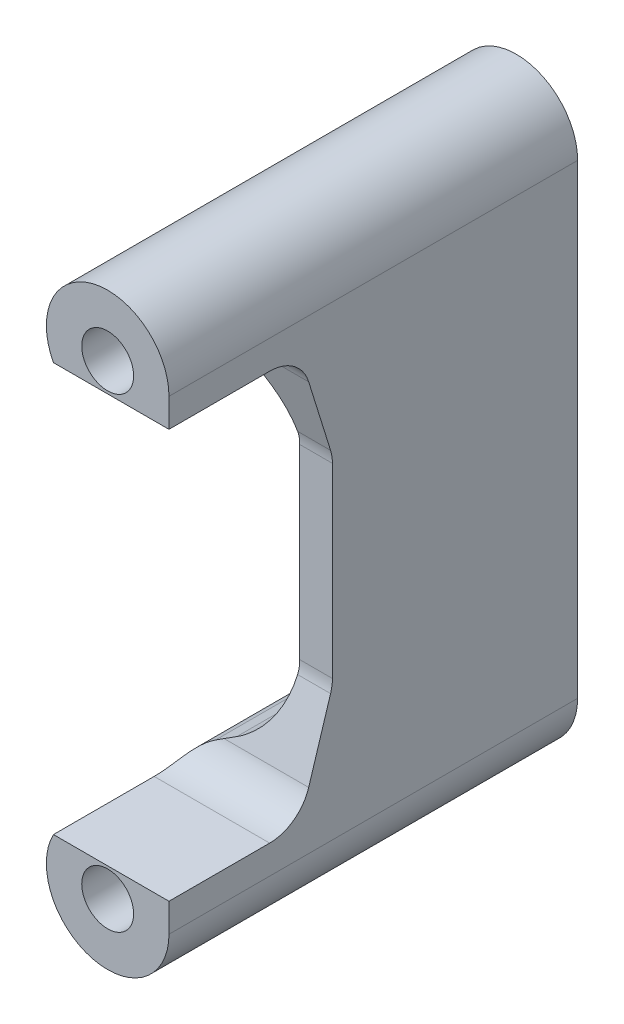
ISO-10303-21;
HEADER;
FILE_DESCRIPTION(('STEP AP214'),'2;1');
FILE_NAME('part.step','',(''),(''),'','','');
FILE_SCHEMA(('AUTOMOTIVE_DESIGN { 1 0 10303 214 1 1 1 1 }'));
ENDSEC;
DATA;
#1=APPLICATION_CONTEXT('core data for automotive mechanical design processes');
#2=APPLICATION_PROTOCOL_DEFINITION('international standard','automotive_design',2000,#1);
#3=PRODUCT_CONTEXT('',#1,'mechanical');
#4=PRODUCT('Part','Part','',(#3));
#5=PRODUCT_RELATED_PRODUCT_CATEGORY('part','',(#4));
#6=PRODUCT_DEFINITION_FORMATION('','',#4);
#7=PRODUCT_DEFINITION_CONTEXT('part definition',#1,'design');
#8=PRODUCT_DEFINITION('design','',#6,#7);
#9=PRODUCT_DEFINITION_SHAPE('','',#8);
#10=(LENGTH_UNIT() NAMED_UNIT(*) SI_UNIT(.MILLI.,.METRE.));
#11=(NAMED_UNIT(*) PLANE_ANGLE_UNIT() SI_UNIT($,.RADIAN.));
#12=(NAMED_UNIT(*) SI_UNIT($,.STERADIAN.) SOLID_ANGLE_UNIT());
#13=UNCERTAINTY_MEASURE_WITH_UNIT(LENGTH_MEASURE(1.E-05),#10,'distance_accuracy_value','');
#14=(GEOMETRIC_REPRESENTATION_CONTEXT(3) GLOBAL_UNCERTAINTY_ASSIGNED_CONTEXT((#13)) GLOBAL_UNIT_ASSIGNED_CONTEXT((#10,
#11,#12)) REPRESENTATION_CONTEXT('',''));
#15=CARTESIAN_POINT('',(0.,0.,0.));
#16=DIRECTION('',(0.,0.,1.));
#17=DIRECTION('',(1.,0.,0.));
#18=AXIS2_PLACEMENT_3D('',#15,#16,#17);
#19=CARTESIAN_POINT('',(-7.5,28.5,25.));
#20=DIRECTION('',(0.,0.,1.));
#21=DIRECTION('',(1.,0.,0.));
#22=AXIS2_PLACEMENT_3D('',#19,#20,#21);
#23=PLANE('',#22);
#24=DIRECTION('',(-1.,0.,0.));
#25=VECTOR('',#24,1.);
#26=CARTESIAN_POINT('',(-7.5,25.,25.));
#27=LINE('',#26,#25);
#28=CARTESIAN_POINT('',(0.,25.,25.));
#29=VERTEX_POINT('',#28);
#30=CARTESIAN_POINT('',(-14.1332495807108,25.,25.));
#31=VERTEX_POINT('',#30);
#32=EDGE_CURVE('E308',#29,#31,#27,.T.);
#33=ORIENTED_EDGE('',*,*,#32,.F.);
#34=DIRECTION('',(0.,1.,0.));
#35=VECTOR('',#34,1.);
#36=CARTESIAN_POINT('',(0.,28.5,25.));
#37=LINE('',#36,#35);
#38=CARTESIAN_POINT('',(0.,28.5,25.));
#39=VERTEX_POINT('',#38);
#40=EDGE_CURVE('E336',#29,#39,#37,.T.);
#41=ORIENTED_EDGE('',*,*,#40,.T.);
#42=CARTESIAN_POINT('',(-7.5,28.5,25.));
#43=DIRECTION('',(0.,0.,1.));
#44=DIRECTION('',(1.,0.,0.));
#45=AXIS2_PLACEMENT_3D('',#42,#43,#44);
#46=CIRCLE('',#45,7.5);
#47=EDGE_CURVE('E331',#39,#31,#46,.T.);
#48=ORIENTED_EDGE('',*,*,#47,.T.);
#49=EDGE_LOOP('',(#33,#41,#48));
#50=FACE_BOUND('',#49,.T.);
#51=CARTESIAN_POINT('',(-7.5,28.5,25.));
#52=DIRECTION('',(0.,0.,1.));
#53=DIRECTION('',(1.,0.,0.));
#54=AXIS2_PLACEMENT_3D('',#51,#52,#53);
#55=CIRCLE('',#54,3.175);
#56=CARTESIAN_POINT('',(-4.325,28.5,25.));
#57=VERTEX_POINT('',#56);
#58=EDGE_CURVE('E325',#57,#57,#55,.T.);
#59=ORIENTED_EDGE('',*,*,#58,.F.);
#60=EDGE_LOOP('',(#59));
#61=FACE_BOUND('',#60,.T.);
#62=ADVANCED_FACE('F33',(#50,#61),#23,.T.);
#63=DIRECTION('',(1.,0.,0.));
#64=VECTOR('',#63,1.);
#65=CARTESIAN_POINT('',(-7.5,-25.,25.));
#66=LINE('',#65,#64);
#67=CARTESIAN_POINT('',(-14.1332495807108,-25.,25.));
#68=VERTEX_POINT('',#67);
#69=CARTESIAN_POINT('',(0.,-25.,25.));
#70=VERTEX_POINT('',#69);
#71=EDGE_CURVE('E310',#68,#70,#66,.T.);
#72=ORIENTED_EDGE('',*,*,#71,.F.);
#73=CARTESIAN_POINT('',(-7.5,-28.5,25.));
#74=DIRECTION('',(0.,0.,1.));
#75=DIRECTION('',(-1.,0.,0.));
#76=AXIS2_PLACEMENT_3D('',#73,#74,#75);
#77=CIRCLE('',#76,7.5);
#78=CARTESIAN_POINT('',(0.,-28.5,25.));
#79=VERTEX_POINT('',#78);
#80=EDGE_CURVE('E333',#68,#79,#77,.T.);
#81=ORIENTED_EDGE('',*,*,#80,.T.);
#82=EDGE_CURVE('E337',#79,#70,#37,.T.);
#83=ORIENTED_EDGE('',*,*,#82,.T.);
#84=EDGE_LOOP('',(#72,#81,#83));
#85=FACE_BOUND('',#84,.T.);
#86=CARTESIAN_POINT('',(-7.5,-28.5,25.));
#87=DIRECTION('',(0.,0.,1.));
#88=DIRECTION('',(-1.,0.,0.));
#89=AXIS2_PLACEMENT_3D('',#86,#87,#88);
#90=CIRCLE('',#89,3.175);
#91=CARTESIAN_POINT('',(-10.675,-28.5,25.));
#92=VERTEX_POINT('',#91);
#93=EDGE_CURVE('E319',#92,#92,#90,.T.);
#94=ORIENTED_EDGE('',*,*,#93,.F.);
#95=EDGE_LOOP('',(#94));
#96=FACE_BOUND('',#95,.T.);
#97=ADVANCED_FACE('F413',(#85,#96),#23,.T.);
#98=CARTESIAN_POINT('',(-7.5,28.5,-25.));
#99=DIRECTION('',(0.,0.,1.));
#100=DIRECTION('',(1.,0.,0.));
#101=AXIS2_PLACEMENT_3D('',#98,#99,#100);
#102=PLANE('',#101);
#103=CARTESIAN_POINT('',(-7.5,28.5,-25.));
#104=DIRECTION('',(0.,0.,1.));
#105=DIRECTION('',(1.,0.,0.));
#106=AXIS2_PLACEMENT_3D('',#103,#104,#105);
#107=CIRCLE('',#106,7.5);
#108=CARTESIAN_POINT('',(0.,28.5,-25.));
#109=VERTEX_POINT('',#108);
#110=CARTESIAN_POINT('',(-11.2336423874422,21.9953928233371,-25.));
#111=VERTEX_POINT('',#110);
#112=EDGE_CURVE('E328',#109,#111,#107,.T.);
#113=ORIENTED_EDGE('',*,*,#112,.F.);
#114=DIRECTION('',(0.,1.,0.));
#115=VECTOR('',#114,1.);
#116=CARTESIAN_POINT('',(0.,28.5,-25.));
#117=LINE('',#116,#115);
#118=CARTESIAN_POINT('',(0.,-28.5,-25.));
#119=VERTEX_POINT('',#118);
#120=EDGE_CURVE('E334',#119,#109,#117,.T.);
#121=ORIENTED_EDGE('',*,*,#120,.F.);
#122=CARTESIAN_POINT('',(-7.5,-28.5,-25.));
#123=DIRECTION('',(0.,0.,1.));
#124=DIRECTION('',(-1.,0.,0.));
#125=AXIS2_PLACEMENT_3D('',#122,#123,#124);
#126=CIRCLE('',#125,7.5);
#127=CARTESIAN_POINT('',(-11.2336423874422,-21.9953928233371,-25.));
#128=VERTEX_POINT('',#127);
#129=EDGE_CURVE('E348',#128,#119,#126,.T.);
#130=ORIENTED_EDGE('',*,*,#129,.F.);
#131=DIRECTION('',(-0.867280956888389,-0.497818984992296,0.));
#132=VECTOR('',#131,1.);
#133=CARTESIAN_POINT('',(-3.99999999999999,-17.8432844638575,-25.));
#134=LINE('',#133,#132);
#135=CARTESIAN_POINT('',(-9.02181015007704,-20.7258018440438,-25.));
#136=VERTEX_POINT('',#135);
#137=EDGE_CURVE('E346',#136,#128,#134,.T.);
#138=ORIENTED_EDGE('',*,*,#137,.F.);
#139=CARTESIAN_POINT('',(-14.,-12.0529922751599,-25.));
#140=DIRECTION('',(0.,0.,1.));
#141=DIRECTION('',(1.,0.,0.));
#142=AXIS2_PLACEMENT_3D('',#139,#140,#141);
#143=CIRCLE('',#142,10.);
#144=CARTESIAN_POINT('',(-3.99999999999999,-12.0529922751599,-25.));
#145=VERTEX_POINT('',#144);
#146=EDGE_CURVE('E192',#136,#145,#143,.T.);
#147=ORIENTED_EDGE('',*,*,#146,.T.);
#148=DIRECTION('',(0.,-1.,0.));
#149=VECTOR('',#148,1.);
#150=CARTESIAN_POINT('',(-3.99999999999999,17.8432844638575,-25.));
#151=LINE('',#150,#149);
#152=CARTESIAN_POINT('',(-3.99999999999999,12.0529922751599,-25.));
#153=VERTEX_POINT('',#152);
#154=EDGE_CURVE('E343',#153,#145,#151,.T.);
#155=ORIENTED_EDGE('',*,*,#154,.F.);
#156=CARTESIAN_POINT('',(-14.,12.0529922751599,-25.));
#157=DIRECTION('',(0.,0.,1.));
#158=DIRECTION('',(1.,0.,0.));
#159=AXIS2_PLACEMENT_3D('',#156,#157,#158);
#160=CIRCLE('',#159,10.);
#161=CARTESIAN_POINT('',(-9.02181015007704,20.7258018440438,-25.));
#162=VERTEX_POINT('',#161);
#163=EDGE_CURVE('E175',#153,#162,#160,.T.);
#164=ORIENTED_EDGE('',*,*,#163,.T.);
#165=DIRECTION('',(0.867280956888389,-0.497818984992296,0.));
#166=VECTOR('',#165,1.);
#167=CARTESIAN_POINT('',(-3.99999999999999,17.8432844638575,-25.));
#168=LINE('',#167,#166);
#169=EDGE_CURVE('E191',#111,#162,#168,.T.);
#170=ORIENTED_EDGE('',*,*,#169,.F.);
#171=EDGE_LOOP('',(#113,#121,#130,#138,#147,#155,#164,#170));
#172=FACE_BOUND('',#171,.T.);
#173=CARTESIAN_POINT('',(-7.5,28.5,-25.));
#174=DIRECTION('',(0.,0.,1.));
#175=DIRECTION('',(1.,0.,0.));
#176=AXIS2_PLACEMENT_3D('',#173,#174,#175);
#177=CIRCLE('',#176,3.175);
#178=CARTESIAN_POINT('',(-4.325,28.5,-25.));
#179=VERTEX_POINT('',#178);
#180=EDGE_CURVE('E322',#179,#179,#177,.T.);
#181=ORIENTED_EDGE('',*,*,#180,.T.);
#182=EDGE_LOOP('',(#181));
#183=FACE_BOUND('',#182,.T.);
#184=CARTESIAN_POINT('',(-7.5,-28.5,-25.));
#185=DIRECTION('',(0.,0.,1.));
#186=DIRECTION('',(-1.,0.,0.));
#187=AXIS2_PLACEMENT_3D('',#184,#185,#186);
#188=CIRCLE('',#187,3.175);
#189=CARTESIAN_POINT('',(-10.675,-28.5,-25.));
#190=VERTEX_POINT('',#189);
#191=EDGE_CURVE('E312',#190,#190,#188,.T.);
#192=ORIENTED_EDGE('',*,*,#191,.T.);
#193=EDGE_LOOP('',(#192));
#194=FACE_BOUND('',#193,.T.);
#195=ADVANCED_FACE('F269',(#172,#183,#194),#102,.F.);
#196=CARTESIAN_POINT('',(-7.5,28.5,25.));
#197=DIRECTION('',(0.,0.,-1.));
#198=DIRECTION('',(-1.,0.,0.));
#199=AXIS2_PLACEMENT_3D('',#196,#197,#198);
#200=CYLINDRICAL_SURFACE('',#199,7.5);
#201=DIRECTION('',(0.,0.,-1.));
#202=VECTOR('',#201,1.);
#203=CARTESIAN_POINT('',(-11.2336423874422,21.9953928233371,25.));
#204=LINE('',#203,#202);
#205=CARTESIAN_POINT('',(-11.2336423874422,21.9953928233371,8.09485193658644));
#206=VERTEX_POINT('',#205);
#207=EDGE_CURVE('E53',#206,#111,#204,.T.);
#208=ORIENTED_EDGE('',*,*,#207,.F.);
#209=CARTESIAN_POINT('',(-11.2336423874422,21.9953928233371,8.09485193658644));
#210=CARTESIAN_POINT('',(-11.3560536719789,22.0656197845902,8.12543064305941));
#211=CARTESIAN_POINT('',(-11.4758763305029,22.1390266115361,8.15928774878989));
#212=CARTESIAN_POINT('',(-11.7096937323466,22.2913098081038,8.23453359996381));
#213=CARTESIAN_POINT('',(-11.8236829145212,22.3701912339987,8.27592936689037));
#214=CARTESIAN_POINT('',(-12.0455396136685,22.5328301110287,8.36741652776992));
#215=CARTESIAN_POINT('',(-12.1533713107869,22.6166112846279,8.4175530406024));
#216=CARTESIAN_POINT('',(-12.3614479774722,22.7873456868113,8.5272080663632));
#217=CARTESIAN_POINT('',(-12.4616953138911,22.8742979131463,8.58672363434529));
#218=CARTESIAN_POINT('',(-12.6546274891246,23.0505039467807,8.71629732811335));
#219=CARTESIAN_POINT('',(-12.7472524016233,23.139769850336,8.78642857546666));
#220=CARTESIAN_POINT('',(-12.923530996661,23.3182008540901,8.93735166224518));
#221=CARTESIAN_POINT('',(-13.0071837865538,23.4073659433873,9.01814456062927));
#222=CARTESIAN_POINT('',(-13.1647987840719,23.5832981349653,9.19015913587917));
#223=CARTESIAN_POINT('',(-13.2387957846623,23.6700729050285,9.28134101928528));
#224=CARTESIAN_POINT('',(-13.3772726752356,23.8395660089917,9.47409750827047));
#225=CARTESIAN_POINT('',(-13.4417541173825,23.9222850029909,9.57567041429397));
#226=CARTESIAN_POINT('',(-13.5536253718964,24.071548752521,9.77496410420145));
#227=CARTESIAN_POINT('',(-13.6021463445521,24.1388094164584,9.87151766732775));
#228=CARTESIAN_POINT('',(-13.6921841678267,24.267621053841,10.0714578098737));
#229=CARTESIAN_POINT('',(-13.733701320719,24.3291722736448,10.174844094136));
#230=CARTESIAN_POINT('',(-13.8100576398336,24.4456158043211,10.3878730229326));
#231=CARTESIAN_POINT('',(-13.8448867682048,24.5004980613178,10.4975247559617));
#232=CARTESIAN_POINT('',(-13.908121065381,24.6026170339209,10.72210794432));
#233=CARTESIAN_POINT('',(-13.9365264901779,24.6498540541775,10.837039189035));
#234=CARTESIAN_POINT('',(-13.986052888758,24.7339167062162,11.0656952687591));
#235=CARTESIAN_POINT('',(-14.0074566300424,24.7711313926476,11.1792162973726));
#236=CARTESIAN_POINT('',(-14.045041923011,24.8375032716306,11.409431129883));
#237=CARTESIAN_POINT('',(-14.0612236414345,24.8666607214458,11.5261248323474));
#238=CARTESIAN_POINT('',(-14.0885846241731,24.9165156988653,11.7616454373692));
#239=CARTESIAN_POINT('',(-14.0997731386476,24.9372288637171,11.8804679676416));
#240=CARTESIAN_POINT('',(-14.1173723131879,24.9700237064396,12.1195999156));
#241=CARTESIAN_POINT('',(-14.1237854910376,24.9821099327022,12.2399085156938));
#242=CARTESIAN_POINT('',(-14.1296653414612,24.9932139493787,12.4136372155811));
#243=CARTESIAN_POINT('',(-14.1310109113176,24.9957598766258,12.4667938477455));
#244=CARTESIAN_POINT('',(-14.1328021894919,24.9991518272603,12.5731102336541));
#245=CARTESIAN_POINT('',(-14.1332490155842,24.9999999621985,12.6262699011884));
#246=CARTESIAN_POINT('',(-14.1332495807108,25.,12.6794356124042));
#247=B_SPLINE_CURVE_WITH_KNOTS('',3,(#209,#210,#211,#212,#213,#214,#215,#216,#217,#218,#219,
#220,#221,#222,#223,#224,#225,#226,#227,#228,#229,#230,#231,#232,#233,#234,#235,#236,#237,#238,
#239,#240,#241,#242,#243,#244,#245,#246),.UNSPECIFIED.,.F.,.F.,(4,2,2,2,2,2,2,2,2,2,2,2,2,2,2,2,
2,2,4),(0.,0.433176762455773,0.866759067129752,1.30264959188294,1.73840352229851,
2.17730840036047,2.61625690511226,3.05357728306464,3.49082624691382,3.87218395817974,
4.25352520645659,4.6354343997041,5.01732837074899,5.38101186201016,5.7446837397045,
6.10767907165134,6.47048287946062,6.63015799498999,6.78963439828691),.UNSPECIFIED.);
#248=CARTESIAN_POINT('',(-14.1332495807108,25.,12.6794356124042));
#249=VERTEX_POINT('',#248);
#250=EDGE_CURVE('E11',#206,#249,#247,.T.);
#251=ORIENTED_EDGE('',*,*,#250,.T.);
#252=DIRECTION('',(0.,0.,-1.));
#253=VECTOR('',#252,1.);
#254=CARTESIAN_POINT('',(-14.1332495807108,25.,25.));
#255=LINE('',#254,#253);
#256=EDGE_CURVE('E302',#249,#31,#255,.F.);
#257=ORIENTED_EDGE('',*,*,#256,.T.);
#258=ORIENTED_EDGE('',*,*,#47,.F.);
#259=DIRECTION('',(0.,0.,-1.));
#260=VECTOR('',#259,1.);
#261=CARTESIAN_POINT('',(0.,28.5,25.));
#262=LINE('',#261,#260);
#263=EDGE_CURVE('E340',#39,#109,#262,.T.);
#264=ORIENTED_EDGE('',*,*,#263,.T.);
#265=ORIENTED_EDGE('',*,*,#112,.T.);
#266=EDGE_LOOP('',(#208,#251,#257,#258,#264,#265));
#267=FACE_BOUND('',#266,.T.);
#268=ADVANCED_FACE('F265',(#267),#200,.T.);
#269=CARTESIAN_POINT('',(-3.99999999999999,17.8432844638575,25.));
#270=DIRECTION('',(0.497818984992296,0.867280956888389,0.));
#271=DIRECTION('',(-0.867280956888389,0.497818984992296,0.));
#272=AXIS2_PLACEMENT_3D('',#269,#270,#271);
#273=PLANE('',#272);
#274=DIRECTION('',(0.,0.,-1.));
#275=VECTOR('',#274,1.);
#276=CARTESIAN_POINT('',(-9.02181015007703,20.7258018440438,25.));
#277=LINE('',#276,#275);
#278=CARTESIAN_POINT('',(-9.02181015007703,20.7258018440438,7.66855107273537));
#279=VERTEX_POINT('',#278);
#280=EDGE_CURVE('E168',#162,#279,#277,.F.);
#281=ORIENTED_EDGE('',*,*,#280,.T.);
#282=DIRECTION('',(-0.857037076944014,0.491939001261778,0.153243165527288));
#283=VECTOR('',#282,1.);
#284=CARTESIAN_POINT('',(-6.39415665543173,19.217529599362,7.19871149372426));
#285=LINE('',#284,#283);
#286=CARTESIAN_POINT('',(-10.348048387022,21.4870621573598,7.90569010807031));
#287=VERTEX_POINT('',#286);
#288=EDGE_CURVE('E178',#279,#287,#285,.T.);
#289=ORIENTED_EDGE('',*,*,#288,.T.);
#290=CARTESIAN_POINT('',(-7.75734628511741,20.,12.6794356124042));
#291=DIRECTION('',(0.497818984992296,0.867280956888389,0.));
#292=DIRECTION('',(-0.867280956888389,0.497818984992296,0.));
#293=AXIS2_PLACEMENT_3D('',#290,#291,#292);
#294=ELLIPSE('',#293,10.0438114068257,5.);
#295=EDGE_CURVE('E47',#287,#206,#294,.T.);
#296=ORIENTED_EDGE('',*,*,#295,.T.);
#297=ORIENTED_EDGE('',*,*,#207,.T.);
#298=ORIENTED_EDGE('',*,*,#169,.T.);
#299=EDGE_LOOP('',(#281,#289,#296,#297,#298));
#300=FACE_BOUND('',#299,.T.);
#301=ADVANCED_FACE('F189',(#300),#273,.F.);
#302=CARTESIAN_POINT('',(-3.99999999999999,17.8432844638575,25.));
#303=DIRECTION('',(1.,0.,0.));
#304=DIRECTION('',(0.,0.,-1.));
#305=AXIS2_PLACEMENT_3D('',#302,#303,#304);
#306=PLANE('',#305);
#307=DIRECTION('',(0.,0.,-1.));
#308=VECTOR('',#307,1.);
#309=CARTESIAN_POINT('',(-3.99999999999999,-12.0529922751599,25.));
#310=LINE('',#309,#308);
#311=CARTESIAN_POINT('',(-3.99999999999999,-12.0529922751599,5.04301919188461));
#312=VERTEX_POINT('',#311);
#313=EDGE_CURVE('E193',#145,#312,#310,.F.);
#314=ORIENTED_EDGE('',*,*,#313,.T.);
#315=CARTESIAN_POINT('',(-3.99999999999999,-11.3985144161182,10.));
#316=DIRECTION('',(1.,0.,0.));
#317=DIRECTION('',(0.,0.,-1.));
#318=AXIS2_PLACEMENT_3D('',#315,#316,#317);
#319=CIRCLE('',#318,5.);
#320=CARTESIAN_POINT('',(-3.99999999999999,-11.3985144161182,5.));
#321=VERTEX_POINT('',#320);
#322=EDGE_CURVE('E258',#312,#321,#319,.T.);
#323=ORIENTED_EDGE('',*,*,#322,.T.);
#324=DIRECTION('',(0.,1.,0.));
#325=VECTOR('',#324,1.);
#326=CARTESIAN_POINT('',(-3.99999999999999,17.8432844638575,5.));
#327=LINE('',#326,#325);
#328=CARTESIAN_POINT('',(-3.99999999999999,11.3985144161182,5.));
#329=VERTEX_POINT('',#328);
#330=EDGE_CURVE('E186',#321,#329,#327,.T.);
#331=ORIENTED_EDGE('',*,*,#330,.T.);
#332=CARTESIAN_POINT('',(-3.99999999999999,11.3985144161182,10.));
#333=DIRECTION('',(1.,0.,0.));
#334=DIRECTION('',(0.,0.,-1.));
#335=AXIS2_PLACEMENT_3D('',#332,#333,#334);
#336=CIRCLE('',#335,5.);
#337=CARTESIAN_POINT('',(-3.99999999999999,12.0529922751599,5.04301919188461));
#338=VERTEX_POINT('',#337);
#339=EDGE_CURVE('E225',#329,#338,#336,.T.);
#340=ORIENTED_EDGE('',*,*,#339,.T.);
#341=DIRECTION('',(0.,0.,-1.));
#342=VECTOR('',#341,1.);
#343=CARTESIAN_POINT('',(-3.99999999999999,12.0529922751599,-25.));
#344=LINE('',#343,#342);
#345=EDGE_CURVE('E196',#338,#153,#344,.T.);
#346=ORIENTED_EDGE('',*,*,#345,.T.);
#347=ORIENTED_EDGE('',*,*,#154,.T.);
#348=EDGE_LOOP('',(#314,#323,#331,#340,#346,#347));
#349=FACE_BOUND('',#348,.T.);
#350=ADVANCED_FACE('F272',(#349),#306,.F.);
#351=CARTESIAN_POINT('',(-3.99999999999999,-17.8432844638575,25.));
#352=DIRECTION('',(0.497818984992296,-0.867280956888389,0.));
#353=DIRECTION('',(0.867280956888389,0.497818984992296,0.));
#354=AXIS2_PLACEMENT_3D('',#351,#352,#353);
#355=PLANE('',#354);
#356=DIRECTION('',(0.,0.,-1.));
#357=VECTOR('',#356,1.);
#358=CARTESIAN_POINT('',(-11.2336423874422,-21.9953928233371,25.));
#359=LINE('',#358,#357);
#360=CARTESIAN_POINT('',(-11.2336423874422,-21.9953928233371,8.09485193658644));
#361=VERTEX_POINT('',#360);
#362=EDGE_CURVE('E61',#361,#128,#359,.T.);
#363=ORIENTED_EDGE('',*,*,#362,.F.);
#364=CARTESIAN_POINT('',(-7.75734628511741,-20.,12.6794356124042));
#365=DIRECTION('',(0.497818984992296,-0.867280956888389,0.));
#366=DIRECTION('',(-0.867280956888389,-0.497818984992296,0.));
#367=AXIS2_PLACEMENT_3D('',#364,#365,#366);
#368=ELLIPSE('',#367,10.0438114068257,5.);
#369=CARTESIAN_POINT('',(-10.348048387022,-21.4870621573598,7.90569010807031));
#370=VERTEX_POINT('',#369);
#371=EDGE_CURVE('E293',#361,#370,#368,.T.);
#372=ORIENTED_EDGE('',*,*,#371,.T.);
#373=DIRECTION('',(0.857037076944014,0.491939001261778,-0.153243165527288));
#374=VECTOR('',#373,1.);
#375=CARTESIAN_POINT('',(-6.39415665543173,-19.217529599362,7.19871149372426));
#376=LINE('',#375,#374);
#377=CARTESIAN_POINT('',(-9.02181015007703,-20.7258018440438,7.66855107273537));
#378=VERTEX_POINT('',#377);
#379=EDGE_CURVE('E185',#370,#378,#376,.T.);
#380=ORIENTED_EDGE('',*,*,#379,.T.);
#381=DIRECTION('',(0.,0.,-1.));
#382=VECTOR('',#381,1.);
#383=CARTESIAN_POINT('',(-9.02181015007703,-20.7258018440438,-25.));
#384=LINE('',#383,#382);
#385=EDGE_CURVE('E358',#378,#136,#384,.T.);
#386=ORIENTED_EDGE('',*,*,#385,.T.);
#387=ORIENTED_EDGE('',*,*,#137,.T.);
#388=EDGE_LOOP('',(#363,#372,#380,#386,#387));
#389=FACE_BOUND('',#388,.T.);
#390=ADVANCED_FACE('F275',(#389),#355,.F.);
#391=CARTESIAN_POINT('',(-7.5,-28.5,25.));
#392=DIRECTION('',(0.,0.,-1.));
#393=DIRECTION('',(-1.,0.,0.));
#394=AXIS2_PLACEMENT_3D('',#391,#392,#393);
#395=CYLINDRICAL_SURFACE('',#394,7.5);
#396=DIRECTION('',(0.,0.,-1.));
#397=VECTOR('',#396,1.);
#398=CARTESIAN_POINT('',(-14.1332495807108,-25.,25.));
#399=LINE('',#398,#397);
#400=CARTESIAN_POINT('',(-14.1332495807108,-25.,12.6794356124042));
#401=VERTEX_POINT('',#400);
#402=EDGE_CURVE('E315',#68,#401,#399,.T.);
#403=ORIENTED_EDGE('',*,*,#402,.T.);
#404=CARTESIAN_POINT('',(-14.1332495807108,-25.,12.6794356124042));
#405=CARTESIAN_POINT('',(-14.1332343348268,-25.0000191677303,12.5564090657746));
#406=CARTESIAN_POINT('',(-14.1308533077637,-24.995460121307,12.4333823872265));
#407=CARTESIAN_POINT('',(-14.1212486274396,-24.9773217711267,12.1881820339511));
#408=CARTESIAN_POINT('',(-14.1140248173044,-24.9637421751637,12.0660083869859));
#409=CARTESIAN_POINT('',(-14.0946230787782,-24.927698142651,11.8233702586443));
#410=CARTESIAN_POINT('',(-14.0824449385477,-24.9052333261842,11.7029058505803));
#411=CARTESIAN_POINT('',(-14.0529254450282,-24.8516979257263,11.464552007048));
#412=CARTESIAN_POINT('',(-14.0355842552889,-24.8206276143333,11.346662490142));
#413=CARTESIAN_POINT('',(-13.9954523271398,-24.7502347787471,11.1141761138823));
#414=CARTESIAN_POINT('',(-13.9726555650344,-24.7109031388337,10.9995830520439));
#415=CARTESIAN_POINT('',(-13.9213175603875,-24.6245383581321,10.7746637772745));
#416=CARTESIAN_POINT('',(-13.892776340377,-24.5775052475508,10.66433754761));
#417=CARTESIAN_POINT('',(-13.8296577899157,-24.4764473195246,10.4488366882528));
#418=CARTESIAN_POINT('',(-13.795085045271,-24.4224278218877,10.3436582219268));
#419=CARTESIAN_POINT('',(-13.7195960299064,-24.308185405903,10.1391087518665));
#420=CARTESIAN_POINT('',(-13.6786799005215,-24.2479626257787,10.0397376188086));
#421=CARTESIAN_POINT('',(-13.5908569485414,-24.1231054216071,9.84873854997659));
#422=CARTESIAN_POINT('',(-13.5440373294031,-24.058540571271,9.75702499903131));
#423=CARTESIAN_POINT('',(-13.4438304544677,-23.925305814306,9.58036825990199));
#424=CARTESIAN_POINT('',(-13.3904411071621,-23.8566346039903,9.49542724204672));
#425=CARTESIAN_POINT('',(-13.2770789722873,-23.7163311223204,9.33273268091671));
#426=CARTESIAN_POINT('',(-13.2171076641928,-23.6446995186428,9.25497752963161));
#427=CARTESIAN_POINT('',(-13.0906431835537,-23.4996031052656,9.10682716550648));
#428=CARTESIAN_POINT('',(-13.0241495916197,-23.4261381779083,9.03643242655041));
#429=CARTESIAN_POINT('',(-12.8840620811809,-23.2777014060987,8.90229485879563));
#430=CARTESIAN_POINT('',(-12.8103978456101,-23.2027218799985,8.83863409617097));
#431=CARTESIAN_POINT('',(-12.6569153241705,-23.0531934681262,8.71872937958715));
#432=CARTESIAN_POINT('',(-12.577098422709,-22.9786444895112,8.66248376482518));
#433=CARTESIAN_POINT('',(-12.4116024861991,-22.8309196764096,8.55704079004948));
#434=CARTESIAN_POINT('',(-12.3259183892885,-22.7577450988204,8.50784963233554));
#435=CARTESIAN_POINT('',(-12.149204148734,-22.613753153928,8.41615309781156));
#436=CARTESIAN_POINT('',(-12.0581748419109,-22.5429354203539,8.37364667828272));
#437=CARTESIAN_POINT('',(-11.8494905275369,-22.3883360141757,8.28563200841337));
#438=CARTESIAN_POINT('',(-11.730562382297,-22.3053640858833,8.24171997497546));
#439=CARTESIAN_POINT('',(-11.4865600659051,-22.1455762767191,8.16231287987203));
#440=CARTESIAN_POINT('',(-11.3615080637931,-22.0687405066985,8.12678982753181));
#441=CARTESIAN_POINT('',(-11.2336423874422,-21.9953928233371,8.09485193658644));
#442=B_SPLINE_CURVE_WITH_KNOTS('',3,(#404,#405,#406,#407,#408,#409,#410,#411,#412,#413,#414,
#415,#416,#417,#418,#419,#420,#421,#422,#423,#424,#425,#426,#427,#428,#429,#430,#431,#432,#433,
#434,#435,#436,#437,#438,#439,#440,#441),.UNSPECIFIED.,.F.,.F.,(4,2,2,2,2,2,2,2,2,2,2,2,2,2,2,2,
2,2,4),(0.,0.368972746692978,0.737957446235137,1.10695792464843,1.47594671548586,
1.84534481539369,2.21474146647073,2.5838584772957,2.9529672651159,3.31715181050333,
3.68145259743291,4.04567166490711,4.40991416740451,4.77818009358754,5.14636339701657,
5.51486844940131,5.88331596339403,6.33734846541711,6.78984393438081),.UNSPECIFIED.);
#443=EDGE_CURVE('E287',#401,#361,#442,.T.);
#444=ORIENTED_EDGE('',*,*,#443,.T.);
#445=ORIENTED_EDGE('',*,*,#362,.T.);
#446=ORIENTED_EDGE('',*,*,#129,.T.);
#447=DIRECTION('',(0.,0.,-1.));
#448=VECTOR('',#447,1.);
#449=CARTESIAN_POINT('',(0.,-28.5,25.));
#450=LINE('',#449,#448);
#451=EDGE_CURVE('E353',#79,#119,#450,.T.);
#452=ORIENTED_EDGE('',*,*,#451,.F.);
#453=ORIENTED_EDGE('',*,*,#80,.F.);
#454=EDGE_LOOP('',(#403,#444,#445,#446,#452,#453));
#455=FACE_BOUND('',#454,.T.);
#456=ADVANCED_FACE('F279',(#455),#395,.T.);
#457=CARTESIAN_POINT('',(0.,28.5,25.));
#458=DIRECTION('',(-1.,0.,0.));
#459=DIRECTION('',(0.,0.,1.));
#460=AXIS2_PLACEMENT_3D('',#457,#458,#459);
#461=PLANE('',#460);
#462=ORIENTED_EDGE('',*,*,#40,.F.);
#463=DIRECTION('',(0.,0.,1.));
#464=VECTOR('',#463,1.);
#465=CARTESIAN_POINT('',(0.,25.,9.));
#466=LINE('',#465,#464);
#467=CARTESIAN_POINT('',(0.,25.,12.6794356124042));
#468=VERTEX_POINT('',#467);
#469=EDGE_CURVE('E393',#468,#29,#466,.T.);
#470=ORIENTED_EDGE('',*,*,#469,.F.);
#471=CARTESIAN_POINT('',(0.,20.,12.6794356124042));
#472=DIRECTION('',(-1.,0.,0.));
#473=DIRECTION('',(0.,0.,1.));
#474=AXIS2_PLACEMENT_3D('',#471,#472,#473);
#475=CIRCLE('',#474,5.);
#476=CARTESIAN_POINT('',(0.,21.4870621573598,7.9056901080703));
#477=VERTEX_POINT('',#476);
#478=EDGE_CURVE('E296',#468,#477,#475,.T.);
#479=ORIENTED_EDGE('',*,*,#478,.T.);
#480=DIRECTION('',(0.,0.954749100866783,0.29741243147197));
#481=VECTOR('',#480,1.);
#482=CARTESIAN_POINT('',(0.,25.,9.));
#483=LINE('',#482,#481);
#484=CARTESIAN_POINT('',(0.,12.8855765734781,5.22625449566608));
#485=VERTEX_POINT('',#484);
#486=EDGE_CURVE('E379',#485,#477,#483,.T.);
#487=ORIENTED_EDGE('',*,*,#486,.F.);
#488=CARTESIAN_POINT('',(0.,11.3985144161182,10.));
#489=DIRECTION('',(-1.,0.,0.));
#490=DIRECTION('',(0.,0.,1.));
#491=AXIS2_PLACEMENT_3D('',#488,#489,#490);
#492=CIRCLE('',#491,5.);
#493=CARTESIAN_POINT('',(0.,11.3985144161182,5.));
#494=VERTEX_POINT('',#493);
#495=EDGE_CURVE('E223',#485,#494,#492,.T.);
#496=ORIENTED_EDGE('',*,*,#495,.T.);
#497=DIRECTION('',(0.,1.,0.));
#498=VECTOR('',#497,1.);
#499=CARTESIAN_POINT('',(0.,12.1592576525267,5.));
#500=LINE('',#499,#498);
#501=CARTESIAN_POINT('',(0.,-11.3985144161182,5.));
#502=VERTEX_POINT('',#501);
#503=EDGE_CURVE('E387',#502,#494,#500,.T.);
#504=ORIENTED_EDGE('',*,*,#503,.F.);
#505=CARTESIAN_POINT('',(0.,-11.3985144161182,10.));
#506=DIRECTION('',(-1.,0.,0.));
#507=DIRECTION('',(0.,0.,1.));
#508=AXIS2_PLACEMENT_3D('',#505,#506,#507);
#509=CIRCLE('',#508,5.);
#510=CARTESIAN_POINT('',(0.,-12.8855765734781,5.22625449566608));
#511=VERTEX_POINT('',#510);
#512=EDGE_CURVE('E235',#502,#511,#509,.T.);
#513=ORIENTED_EDGE('',*,*,#512,.T.);
#514=DIRECTION('',(0.,0.954749100866783,-0.29741243147197));
#515=VECTOR('',#514,1.);
#516=CARTESIAN_POINT('',(0.,-25.,9.));
#517=LINE('',#516,#515);
#518=CARTESIAN_POINT('',(0.,-21.4870621573598,7.9056901080703));
#519=VERTEX_POINT('',#518);
#520=EDGE_CURVE('E386',#519,#511,#517,.T.);
#521=ORIENTED_EDGE('',*,*,#520,.F.);
#522=CARTESIAN_POINT('',(0.,-20.,12.6794356124042));
#523=DIRECTION('',(-1.,0.,0.));
#524=DIRECTION('',(0.,0.,1.));
#525=AXIS2_PLACEMENT_3D('',#522,#523,#524);
#526=CIRCLE('',#525,5.);
#527=CARTESIAN_POINT('',(0.,-25.,12.6794356124042));
#528=VERTEX_POINT('',#527);
#529=EDGE_CURVE('E294',#519,#528,#526,.T.);
#530=ORIENTED_EDGE('',*,*,#529,.T.);
#531=DIRECTION('',(0.,0.,1.));
#532=VECTOR('',#531,1.);
#533=CARTESIAN_POINT('',(0.,-25.,25.));
#534=LINE('',#533,#532);
#535=EDGE_CURVE('E203',#528,#70,#534,.T.);
#536=ORIENTED_EDGE('',*,*,#535,.T.);
#537=ORIENTED_EDGE('',*,*,#82,.F.);
#538=ORIENTED_EDGE('',*,*,#451,.T.);
#539=ORIENTED_EDGE('',*,*,#120,.T.);
#540=ORIENTED_EDGE('',*,*,#263,.F.);
#541=EDGE_LOOP('',(#462,#470,#479,#487,#496,#504,#513,#521,#530,#536,#537,#538,#539,#540));
#542=FACE_BOUND('',#541,.T.);
#543=ADVANCED_FACE('F283',(#542),#461,.F.);
#544=CARTESIAN_POINT('',(-7.5,28.5,25.));
#545=DIRECTION('',(0.,0.,-1.));
#546=DIRECTION('',(-1.,0.,0.));
#547=AXIS2_PLACEMENT_3D('',#544,#545,#546);
#548=CYLINDRICAL_SURFACE('',#547,3.175);
#549=ORIENTED_EDGE('',*,*,#58,.T.);
#550=EDGE_LOOP('',(#549));
#551=FACE_BOUND('',#550,.T.);
#552=ORIENTED_EDGE('',*,*,#180,.F.);
#553=EDGE_LOOP('',(#552));
#554=FACE_BOUND('',#553,.T.);
#555=ADVANCED_FACE('F430',(#551,#554),#548,.F.);
#556=CARTESIAN_POINT('',(-7.5,-28.5,25.));
#557=DIRECTION('',(0.,0.,-1.));
#558=DIRECTION('',(-1.,0.,0.));
#559=AXIS2_PLACEMENT_3D('',#556,#557,#558);
#560=CYLINDRICAL_SURFACE('',#559,3.175);
#561=ORIENTED_EDGE('',*,*,#93,.T.);
#562=EDGE_LOOP('',(#561));
#563=FACE_BOUND('',#562,.T.);
#564=ORIENTED_EDGE('',*,*,#191,.F.);
#565=EDGE_LOOP('',(#564));
#566=FACE_BOUND('',#565,.T.);
#567=ADVANCED_FACE('F263',(#563,#566),#560,.F.);
#568=CARTESIAN_POINT('',(-14.,-12.0529922751599,25.));
#569=DIRECTION('',(0.,0.,1.));
#570=DIRECTION('',(1.,0.,0.));
#571=AXIS2_PLACEMENT_3D('',#568,#569,#570);
#572=CYLINDRICAL_SURFACE('',#571,10.);
#573=CARTESIAN_POINT('',(-14.,-12.0529922751599,4.96689743490174));
#574=DIRECTION('',(0.,-0.29741243147197,-0.954749100866783));
#575=DIRECTION('',(0.,-0.954749100866783,0.29741243147197));
#576=AXIS2_PLACEMENT_3D('',#573,#574,#575);
#577=ELLIPSE('',#576,10.4739559229973,10.);
#578=CARTESIAN_POINT('',(-4.03472010497477,-12.8855765734781,5.22625449566608));
#579=VERTEX_POINT('',#578);
#580=EDGE_CURVE('E174',#378,#579,#577,.F.);
#581=ORIENTED_EDGE('',*,*,#580,.T.);
#582=CARTESIAN_POINT('',(-4.03472010497477,-12.8855765734781,5.22625449566608));
#583=CARTESIAN_POINT('',(-4.02905032270225,-12.8177341702088,5.20511935244962));
#584=CARTESIAN_POINT('',(-4.02403946414447,-12.7493888499421,5.18541746259862));
#585=CARTESIAN_POINT('',(-4.01539986435419,-12.6119911513895,5.14896806528699));
#586=CARTESIAN_POINT('',(-4.0117680918718,-12.5429406704306,5.13221412224418));
#587=CARTESIAN_POINT('',(-4.00592536397573,-12.4041295922366,5.10165451229548));
#588=CARTESIAN_POINT('',(-4.00371441976181,-12.3343689894083,5.08784886863031));
#589=CARTESIAN_POINT('',(-4.00074919659254,-12.1941375077381,5.06319254984648));
#590=CARTESIAN_POINT('',(-3.99999815616573,-12.1236653975766,5.05234849011822));
#591=CARTESIAN_POINT('',(-3.99999999999999,-12.0529922751599,5.04301919188461));
#592=B_SPLINE_CURVE_WITH_KNOTS('',3,(#582,#583,#584,#585,#586,#587,#588,#589,#590,#591),
.UNSPECIFIED.,.F.,.F.,(4,2,2,2,4),(0.,0.21383520584859,0.427197640267391,0.640561756507801,
0.85439864414725),.UNSPECIFIED.);
#593=EDGE_CURVE('E251',#579,#312,#592,.T.);
#594=ORIENTED_EDGE('',*,*,#593,.T.);
#595=ORIENTED_EDGE('',*,*,#313,.F.);
#596=ORIENTED_EDGE('',*,*,#146,.F.);
#597=ORIENTED_EDGE('',*,*,#385,.F.);
#598=EDGE_LOOP('',(#581,#594,#595,#596,#597));
#599=FACE_BOUND('',#598,.T.);
#600=ADVANCED_FACE('F260',(#599),#572,.F.);
#601=CARTESIAN_POINT('',(-14.,12.0529922751599,25.));
#602=DIRECTION('',(0.,0.,1.));
#603=DIRECTION('',(1.,0.,0.));
#604=AXIS2_PLACEMENT_3D('',#601,#602,#603);
#605=CYLINDRICAL_SURFACE('',#604,10.);
#606=ORIENTED_EDGE('',*,*,#345,.F.);
#607=CARTESIAN_POINT('',(-3.99999999999999,12.0529922751599,5.04301919188461));
#608=CARTESIAN_POINT('',(-3.99999815616573,12.1236653975766,5.05234849011822));
#609=CARTESIAN_POINT('',(-4.00074919659254,12.1941375077381,5.06319254984648));
#610=CARTESIAN_POINT('',(-4.00371441976181,12.3343689894083,5.08784886863031));
#611=CARTESIAN_POINT('',(-4.00592536397573,12.4041295922366,5.10165451229548));
#612=CARTESIAN_POINT('',(-4.0117680918718,12.5429406704306,5.13221412224418));
#613=CARTESIAN_POINT('',(-4.01539986435419,12.6119911513895,5.14896806528699));
#614=CARTESIAN_POINT('',(-4.02403946414447,12.749388849942,5.18541746259862));
#615=CARTESIAN_POINT('',(-4.02905032270225,12.8177341702088,5.20511935244962));
#616=CARTESIAN_POINT('',(-4.03472010497477,12.8855765734781,5.22625449566608));
#617=B_SPLINE_CURVE_WITH_KNOTS('',3,(#607,#608,#609,#610,#611,#612,#613,#614,#615,#616),
.UNSPECIFIED.,.F.,.F.,(4,2,2,2,4),(0.,0.213836887639448,0.427201003879855,0.640563438298656,
0.854398644147244),.UNSPECIFIED.);
#618=CARTESIAN_POINT('',(-4.03472010497477,12.8855765734781,5.22625449566608));
#619=VERTEX_POINT('',#618);
#620=EDGE_CURVE('E170',#338,#619,#617,.T.);
#621=ORIENTED_EDGE('',*,*,#620,.T.);
#622=CARTESIAN_POINT('',(-14.,12.0529922751599,4.96689743490174));
#623=DIRECTION('',(0.,0.29741243147197,-0.954749100866783));
#624=DIRECTION('',(0.,0.954749100866783,0.29741243147197));
#625=AXIS2_PLACEMENT_3D('',#622,#623,#624);
#626=ELLIPSE('',#625,10.4739559229973,10.);
#627=EDGE_CURVE('E163',#619,#279,#626,.F.);
#628=ORIENTED_EDGE('',*,*,#627,.T.);
#629=ORIENTED_EDGE('',*,*,#280,.F.);
#630=ORIENTED_EDGE('',*,*,#163,.F.);
#631=EDGE_LOOP('',(#606,#621,#628,#629,#630));
#632=FACE_BOUND('',#631,.T.);
#633=ADVANCED_FACE('F165',(#632),#605,.F.);
#634=CARTESIAN_POINT('',(-15.,-25.,9.));
#635=DIRECTION('',(0.,-0.29741243147197,-0.954749100866783));
#636=DIRECTION('',(0.,0.954749100866783,-0.29741243147197));
#637=AXIS2_PLACEMENT_3D('',#634,#635,#636);
#638=PLANE('',#637);
#639=ORIENTED_EDGE('',*,*,#520,.T.);
#640=DIRECTION('',(1.,0.,0.));
#641=VECTOR('',#640,1.);
#642=CARTESIAN_POINT('',(-4.00056463246183,-12.8855765734781,5.22625449566608));
#643=LINE('',#642,#641);
#644=EDGE_CURVE('E216',#511,#579,#643,.F.);
#645=ORIENTED_EDGE('',*,*,#644,.T.);
#646=ORIENTED_EDGE('',*,*,#580,.F.);
#647=ORIENTED_EDGE('',*,*,#379,.F.);
#648=DIRECTION('',(1.,0.,0.));
#649=VECTOR('',#648,1.);
#650=CARTESIAN_POINT('',(0.,-21.4870621573598,7.9056901080703));
#651=LINE('',#650,#649);
#652=EDGE_CURVE('E213',#370,#519,#651,.T.);
#653=ORIENTED_EDGE('',*,*,#652,.T.);
#654=EDGE_LOOP('',(#639,#645,#646,#647,#653));
#655=FACE_BOUND('',#654,.T.);
#656=ADVANCED_FACE('F389',(#655),#638,.F.);
#657=CARTESIAN_POINT('',(-15.,25.,9.));
#658=DIRECTION('',(0.,0.29741243147197,-0.954749100866783));
#659=DIRECTION('',(0.,0.954749100866783,0.29741243147197));
#660=AXIS2_PLACEMENT_3D('',#657,#658,#659);
#661=PLANE('',#660);
#662=ORIENTED_EDGE('',*,*,#627,.F.);
#663=DIRECTION('',(1.,0.,0.));
#664=VECTOR('',#663,1.);
#665=CARTESIAN_POINT('',(0.,12.8855765734781,5.22625449566608));
#666=LINE('',#665,#664);
#667=EDGE_CURVE('E206',#619,#485,#666,.T.);
#668=ORIENTED_EDGE('',*,*,#667,.T.);
#669=ORIENTED_EDGE('',*,*,#486,.T.);
#670=DIRECTION('',(1.,0.,0.));
#671=VECTOR('',#670,1.);
#672=CARTESIAN_POINT('',(-14.1332495807108,21.4870621573598,7.9056901080703));
#673=LINE('',#672,#671);
#674=EDGE_CURVE('E182',#477,#287,#673,.F.);
#675=ORIENTED_EDGE('',*,*,#674,.T.);
#676=ORIENTED_EDGE('',*,*,#288,.F.);
#677=EDGE_LOOP('',(#662,#668,#669,#675,#676));
#678=FACE_BOUND('',#677,.T.);
#679=ADVANCED_FACE('F179',(#678),#661,.F.);
#680=CARTESIAN_POINT('',(-15.,12.1592576525267,5.));
#681=DIRECTION('',(0.,0.,-1.));
#682=DIRECTION('',(-1.,0.,0.));
#683=AXIS2_PLACEMENT_3D('',#680,#681,#682);
#684=PLANE('',#683);
#685=ORIENTED_EDGE('',*,*,#503,.T.);
#686=DIRECTION('',(1.,0.,0.));
#687=VECTOR('',#686,1.);
#688=CARTESIAN_POINT('',(-4.00056463246183,11.3985144161182,5.));
#689=LINE('',#688,#687);
#690=EDGE_CURVE('E211',#494,#329,#689,.F.);
#691=ORIENTED_EDGE('',*,*,#690,.T.);
#692=ORIENTED_EDGE('',*,*,#330,.F.);
#693=DIRECTION('',(1.,0.,0.));
#694=VECTOR('',#693,1.);
#695=CARTESIAN_POINT('',(0.,-11.3985144161182,5.));
#696=LINE('',#695,#694);
#697=EDGE_CURVE('E208',#321,#502,#696,.T.);
#698=ORIENTED_EDGE('',*,*,#697,.T.);
#699=EDGE_LOOP('',(#685,#691,#692,#698));
#700=FACE_BOUND('',#699,.T.);
#701=ADVANCED_FACE('F376',(#700),#684,.F.);
#702=CARTESIAN_POINT('',(-15.,25.,9.));
#703=DIRECTION('',(0.,1.,0.));
#704=DIRECTION('',(0.,0.,1.));
#705=AXIS2_PLACEMENT_3D('',#702,#703,#704);
#706=PLANE('',#705);
#707=ORIENTED_EDGE('',*,*,#256,.F.);
#708=DIRECTION('',(1.,0.,0.));
#709=VECTOR('',#708,1.);
#710=CARTESIAN_POINT('',(0.,25.,12.6794356124042));
#711=LINE('',#710,#709);
#712=EDGE_CURVE('E220',#249,#468,#711,.T.);
#713=ORIENTED_EDGE('',*,*,#712,.T.);
#714=ORIENTED_EDGE('',*,*,#469,.T.);
#715=ORIENTED_EDGE('',*,*,#32,.T.);
#716=EDGE_LOOP('',(#707,#713,#714,#715));
#717=FACE_BOUND('',#716,.T.);
#718=ADVANCED_FACE('F305',(#717),#706,.F.);
#719=CARTESIAN_POINT('',(-15.,-25.,9.));
#720=DIRECTION('',(0.,-1.,0.));
#721=DIRECTION('',(0.,0.,-1.));
#722=AXIS2_PLACEMENT_3D('',#719,#720,#721);
#723=PLANE('',#722);
#724=ORIENTED_EDGE('',*,*,#535,.F.);
#725=DIRECTION('',(1.,0.,0.));
#726=VECTOR('',#725,1.);
#727=CARTESIAN_POINT('',(-14.1332495807108,-25.,12.6794356124042));
#728=LINE('',#727,#726);
#729=EDGE_CURVE('E218',#528,#401,#728,.F.);
#730=ORIENTED_EDGE('',*,*,#729,.T.);
#731=ORIENTED_EDGE('',*,*,#402,.F.);
#732=ORIENTED_EDGE('',*,*,#71,.T.);
#733=EDGE_LOOP('',(#724,#730,#731,#732));
#734=FACE_BOUND('',#733,.T.);
#735=ADVANCED_FACE('F244',(#734),#723,.F.);
#736=CARTESIAN_POINT('',(-15.,11.3985144161182,10.));
#737=DIRECTION('',(-1.,0.,0.));
#738=DIRECTION('',(0.,0.,1.));
#739=AXIS2_PLACEMENT_3D('',#736,#737,#738);
#740=CYLINDRICAL_SURFACE('',#739,5.);
#741=ORIENTED_EDGE('',*,*,#339,.F.);
#742=ORIENTED_EDGE('',*,*,#690,.F.);
#743=ORIENTED_EDGE('',*,*,#495,.F.);
#744=ORIENTED_EDGE('',*,*,#667,.F.);
#745=ORIENTED_EDGE('',*,*,#620,.F.);
#746=EDGE_LOOP('',(#741,#742,#743,#744,#745));
#747=FACE_BOUND('',#746,.T.);
#748=ADVANCED_FACE('F239',(#747),#740,.F.);
#749=CARTESIAN_POINT('',(-15.,-11.3985144161182,10.));
#750=DIRECTION('',(-1.,0.,0.));
#751=DIRECTION('',(0.,0.,1.));
#752=AXIS2_PLACEMENT_3D('',#749,#750,#751);
#753=CYLINDRICAL_SURFACE('',#752,5.);
#754=ORIENTED_EDGE('',*,*,#593,.F.);
#755=ORIENTED_EDGE('',*,*,#644,.F.);
#756=ORIENTED_EDGE('',*,*,#512,.F.);
#757=ORIENTED_EDGE('',*,*,#697,.F.);
#758=ORIENTED_EDGE('',*,*,#322,.F.);
#759=EDGE_LOOP('',(#754,#755,#756,#757,#758));
#760=FACE_BOUND('',#759,.T.);
#761=ADVANCED_FACE('F243',(#760),#753,.F.);
#762=CARTESIAN_POINT('',(-15.,-20.,12.6794356124042));
#763=DIRECTION('',(-1.,0.,0.));
#764=DIRECTION('',(0.,0.,1.));
#765=AXIS2_PLACEMENT_3D('',#762,#763,#764);
#766=CYLINDRICAL_SURFACE('',#765,5.);
#767=ORIENTED_EDGE('',*,*,#443,.F.);
#768=ORIENTED_EDGE('',*,*,#729,.F.);
#769=ORIENTED_EDGE('',*,*,#529,.F.);
#770=ORIENTED_EDGE('',*,*,#652,.F.);
#771=ORIENTED_EDGE('',*,*,#371,.F.);
#772=EDGE_LOOP('',(#767,#768,#769,#770,#771));
#773=FACE_BOUND('',#772,.T.);
#774=ADVANCED_FACE('F248',(#773),#766,.F.);
#775=CARTESIAN_POINT('',(-15.,20.,12.6794356124042));
#776=DIRECTION('',(-1.,0.,0.));
#777=DIRECTION('',(0.,0.,1.));
#778=AXIS2_PLACEMENT_3D('',#775,#776,#777);
#779=CYLINDRICAL_SURFACE('',#778,5.);
#780=ORIENTED_EDGE('',*,*,#295,.F.);
#781=ORIENTED_EDGE('',*,*,#674,.F.);
#782=ORIENTED_EDGE('',*,*,#478,.F.);
#783=ORIENTED_EDGE('',*,*,#712,.F.);
#784=ORIENTED_EDGE('',*,*,#250,.F.);
#785=EDGE_LOOP('',(#780,#781,#782,#783,#784));
#786=FACE_BOUND('',#785,.T.);
#787=ADVANCED_FACE('F35',(#786),#779,.F.);
#788=CLOSED_SHELL('',(#62,#97,#195,#268,#301,#350,#390,#456,#543,#555,#567,#600,#633,#656,#679,
#701,#718,#735,#748,#761,#774,#787));
#789=MANIFOLD_SOLID_BREP('B2',#788);
#790=ADVANCED_BREP_SHAPE_REPRESENTATION('',(#18,#789),#14);
#791=SHAPE_DEFINITION_REPRESENTATION(#9,#790);
ENDSEC;
END-ISO-10303-21;
